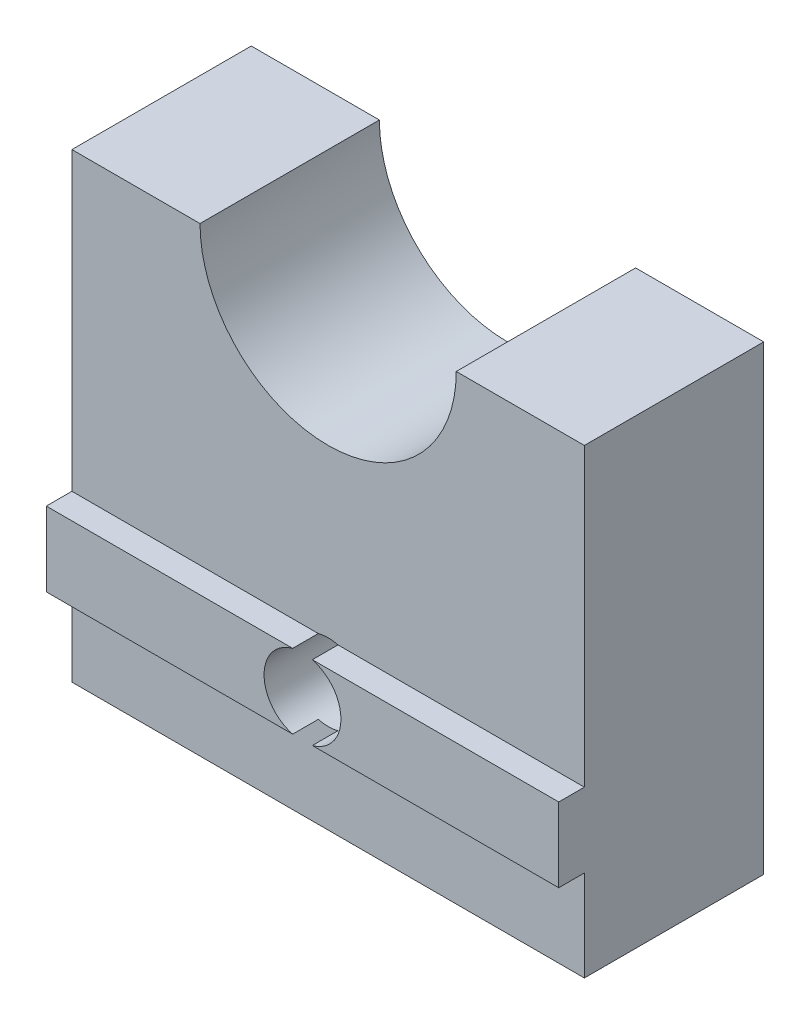
ISO-10303-21;
HEADER;
FILE_DESCRIPTION(('STEP AP214'),'2;1');
FILE_NAME('part.step','',(''),(''),'','','');
FILE_SCHEMA(('AUTOMOTIVE_DESIGN { 1 0 10303 214 1 1 1 1 }'));
ENDSEC;
DATA;
#1=APPLICATION_CONTEXT('core data for automotive mechanical design processes');
#2=APPLICATION_PROTOCOL_DEFINITION('international standard','automotive_design',2000,#1);
#3=PRODUCT_CONTEXT('',#1,'mechanical');
#4=PRODUCT('Part','Part','',(#3));
#5=PRODUCT_RELATED_PRODUCT_CATEGORY('part','',(#4));
#6=PRODUCT_DEFINITION_FORMATION('','',#4);
#7=PRODUCT_DEFINITION_CONTEXT('part definition',#1,'design');
#8=PRODUCT_DEFINITION('design','',#6,#7);
#9=PRODUCT_DEFINITION_SHAPE('','',#8);
#10=(LENGTH_UNIT() NAMED_UNIT(*) SI_UNIT(.MILLI.,.METRE.));
#11=(NAMED_UNIT(*) PLANE_ANGLE_UNIT() SI_UNIT($,.RADIAN.));
#12=(NAMED_UNIT(*) SI_UNIT($,.STERADIAN.) SOLID_ANGLE_UNIT());
#13=UNCERTAINTY_MEASURE_WITH_UNIT(LENGTH_MEASURE(1.E-05),#10,'distance_accuracy_value','');
#14=(GEOMETRIC_REPRESENTATION_CONTEXT(3) GLOBAL_UNCERTAINTY_ASSIGNED_CONTEXT((#13)) GLOBAL_UNIT_ASSIGNED_CONTEXT((#10,
#11,#12)) REPRESENTATION_CONTEXT('',''));
#15=CARTESIAN_POINT('',(0.,0.,0.));
#16=DIRECTION('',(0.,0.,1.));
#17=DIRECTION('',(1.,0.,0.));
#18=AXIS2_PLACEMENT_3D('',#15,#16,#17);
#19=CARTESIAN_POINT('',(13.0675723300356,6.45,7.));
#20=DIRECTION('',(0.,1.,0.));
#21=DIRECTION('',(0.,0.,1.));
#22=AXIS2_PLACEMENT_3D('',#19,#20,#21);
#23=PLANE('',#22);
#24=DIRECTION('',(0.,0.,1.));
#25=VECTOR('',#24,1.);
#26=CARTESIAN_POINT('',(-0.384057287393406,6.45000000000001,0.));
#27=LINE('',#26,#25);
#28=CARTESIAN_POINT('',(-0.384057287393428,6.45,7.));
#29=VERTEX_POINT('',#28);
#30=CARTESIAN_POINT('',(-0.384057287393431,6.45,8.));
#31=VERTEX_POINT('',#30);
#32=EDGE_CURVE('E240',#29,#31,#27,.T.);
#33=ORIENTED_EDGE('',*,*,#32,.F.);
#34=DIRECTION('',(-1.,0.,0.));
#35=VECTOR('',#34,1.);
#36=CARTESIAN_POINT('',(13.0675723300356,6.45,7.));
#37=LINE('',#36,#35);
#38=CARTESIAN_POINT('',(-10.,6.45,7.));
#39=VERTEX_POINT('',#38);
#40=EDGE_CURVE('E154',#29,#39,#37,.T.);
#41=ORIENTED_EDGE('',*,*,#40,.T.);
#42=DIRECTION('',(0.,0.,-1.));
#43=VECTOR('',#42,1.);
#44=CARTESIAN_POINT('',(-10.,6.45,7.));
#45=LINE('',#44,#43);
#46=CARTESIAN_POINT('',(-10.,6.45,8.));
#47=VERTEX_POINT('',#46);
#48=EDGE_CURVE('E230',#47,#39,#45,.T.);
#49=ORIENTED_EDGE('',*,*,#48,.F.);
#50=DIRECTION('',(-1.,0.,0.));
#51=VECTOR('',#50,1.);
#52=CARTESIAN_POINT('',(13.0675723300356,6.45,8.));
#53=LINE('',#52,#51);
#54=EDGE_CURVE('E155',#31,#47,#53,.T.);
#55=ORIENTED_EDGE('',*,*,#54,.F.);
#56=EDGE_LOOP('',(#33,#41,#49,#55));
#57=FACE_BOUND('',#56,.T.);
#58=ADVANCED_FACE('F33',(#57),#23,.T.);
#59=CARTESIAN_POINT('',(13.0675723300356,6.45,8.));
#60=DIRECTION('',(0.,0.,1.));
#61=DIRECTION('',(0.,-1.,0.));
#62=AXIS2_PLACEMENT_3D('',#59,#60,#61);
#63=PLANE('',#62);
#64=CARTESIAN_POINT('',(0.,5.,8.));
#65=DIRECTION('',(0.,0.,1.));
#66=DIRECTION('',(1.,0.,0.));
#67=AXIS2_PLACEMENT_3D('',#64,#65,#66);
#68=CIRCLE('',#67,1.5);
#69=CARTESIAN_POINT('',(0.384057287393432,3.55,8.));
#70=VERTEX_POINT('',#69);
#71=CARTESIAN_POINT('',(0.384057287393431,6.45,8.));
#72=VERTEX_POINT('',#71);
#73=EDGE_CURVE('E132',#70,#72,#68,.T.);
#74=ORIENTED_EDGE('',*,*,#73,.F.);
#75=DIRECTION('',(-1.,0.,0.));
#76=VECTOR('',#75,1.);
#77=CARTESIAN_POINT('',(13.0675723300356,3.55,8.));
#78=LINE('',#77,#76);
#79=CARTESIAN_POINT('',(10.,3.55,8.));
#80=VERTEX_POINT('',#79);
#81=EDGE_CURVE('E158',#80,#70,#78,.T.);
#82=ORIENTED_EDGE('',*,*,#81,.F.);
#83=DIRECTION('',(0.,-1.,0.));
#84=VECTOR('',#83,1.);
#85=CARTESIAN_POINT('',(10.,6.45,8.));
#86=LINE('',#85,#84);
#87=CARTESIAN_POINT('',(10.,6.45,8.));
#88=VERTEX_POINT('',#87);
#89=EDGE_CURVE('E153',#88,#80,#86,.T.);
#90=ORIENTED_EDGE('',*,*,#89,.F.);
#91=EDGE_CURVE('E147',#88,#72,#53,.T.);
#92=ORIENTED_EDGE('',*,*,#91,.T.);
#93=EDGE_LOOP('',(#74,#82,#90,#92));
#94=FACE_BOUND('',#93,.T.);
#95=ADVANCED_FACE('F152',(#94),#63,.T.);
#96=CARTESIAN_POINT('',(13.0675723300356,3.55,7.));
#97=DIRECTION('',(0.,-1.,0.));
#98=DIRECTION('',(0.,0.,-1.));
#99=AXIS2_PLACEMENT_3D('',#96,#97,#98);
#100=PLANE('',#99);
#101=DIRECTION('',(0.,0.,1.));
#102=VECTOR('',#101,1.);
#103=CARTESIAN_POINT('',(0.38405728739346,3.55000000000001,0.));
#104=LINE('',#103,#102);
#105=CARTESIAN_POINT('',(0.384057287393436,3.55,7.));
#106=VERTEX_POINT('',#105);
#107=EDGE_CURVE('E11',#106,#70,#104,.T.);
#108=ORIENTED_EDGE('',*,*,#107,.F.);
#109=DIRECTION('',(-1.,0.,0.));
#110=VECTOR('',#109,1.);
#111=CARTESIAN_POINT('',(13.0675723300356,3.55,7.));
#112=LINE('',#111,#110);
#113=CARTESIAN_POINT('',(10.,3.55,7.));
#114=VERTEX_POINT('',#113);
#115=EDGE_CURVE('E163',#114,#106,#112,.T.);
#116=ORIENTED_EDGE('',*,*,#115,.F.);
#117=DIRECTION('',(0.,0.,-1.));
#118=VECTOR('',#117,1.);
#119=CARTESIAN_POINT('',(10.,3.55,7.));
#120=LINE('',#119,#118);
#121=EDGE_CURVE('E167',#80,#114,#120,.T.);
#122=ORIENTED_EDGE('',*,*,#121,.F.);
#123=ORIENTED_EDGE('',*,*,#81,.T.);
#124=EDGE_LOOP('',(#108,#116,#122,#123));
#125=FACE_BOUND('',#124,.T.);
#126=ADVANCED_FACE('F257',(#125),#100,.T.);
#127=CARTESIAN_POINT('',(0.,18.,7.));
#128=DIRECTION('',(0.,0.,1.));
#129=DIRECTION('',(1.,0.,0.));
#130=AXIS2_PLACEMENT_3D('',#127,#128,#129);
#131=PLANE('',#130);
#132=CARTESIAN_POINT('',(0.,5.,7.));
#133=DIRECTION('',(0.,0.,1.));
#134=DIRECTION('',(1.,0.,0.));
#135=AXIS2_PLACEMENT_3D('',#132,#133,#134);
#136=CIRCLE('',#135,1.5);
#137=CARTESIAN_POINT('',(-0.38405728739346,3.55000000000001,7.));
#138=VERTEX_POINT('',#137);
#139=EDGE_CURVE('E149',#138,#106,#136,.T.);
#140=ORIENTED_EDGE('',*,*,#139,.F.);
#141=CARTESIAN_POINT('',(-10.,3.55,7.));
#142=VERTEX_POINT('',#141);
#143=EDGE_CURVE('E166',#138,#142,#112,.T.);
#144=ORIENTED_EDGE('',*,*,#143,.T.);
#145=DIRECTION('',(0.,-1.,0.));
#146=VECTOR('',#145,1.);
#147=CARTESIAN_POINT('',(-10.,18.,7.));
#148=LINE('',#147,#146);
#149=CARTESIAN_POINT('',(-10.,0.,7.));
#150=VERTEX_POINT('',#149);
#151=EDGE_CURVE('E176',#142,#150,#148,.T.);
#152=ORIENTED_EDGE('',*,*,#151,.T.);
#153=DIRECTION('',(1.,0.,0.));
#154=VECTOR('',#153,1.);
#155=CARTESIAN_POINT('',(-10.,0.,7.));
#156=LINE('',#155,#154);
#157=CARTESIAN_POINT('',(10.,0.,7.));
#158=VERTEX_POINT('',#157);
#159=EDGE_CURVE('E175',#150,#158,#156,.T.);
#160=ORIENTED_EDGE('',*,*,#159,.T.);
#161=DIRECTION('',(0.,1.,0.));
#162=VECTOR('',#161,1.);
#163=CARTESIAN_POINT('',(10.,0.,7.));
#164=LINE('',#163,#162);
#165=EDGE_CURVE('E179',#158,#114,#164,.T.);
#166=ORIENTED_EDGE('',*,*,#165,.T.);
#167=ORIENTED_EDGE('',*,*,#115,.T.);
#168=EDGE_LOOP('',(#140,#144,#152,#160,#166,#167));
#169=FACE_BOUND('',#168,.T.);
#170=ADVANCED_FACE('F221',(#169),#131,.T.);
#171=CARTESIAN_POINT('',(-10.,18.,7.));
#172=DIRECTION('',(1.,0.,0.));
#173=DIRECTION('',(0.,1.,0.));
#174=AXIS2_PLACEMENT_3D('',#171,#172,#173);
#175=PLANE('',#174);
#176=DIRECTION('',(0.,-1.,0.));
#177=VECTOR('',#176,1.);
#178=CARTESIAN_POINT('',(-10.,18.,0.));
#179=LINE('',#178,#177);
#180=CARTESIAN_POINT('',(-10.,18.,0.));
#181=VERTEX_POINT('',#180);
#182=CARTESIAN_POINT('',(-10.,0.,0.));
#183=VERTEX_POINT('',#182);
#184=EDGE_CURVE('E170',#181,#183,#179,.T.);
#185=ORIENTED_EDGE('',*,*,#184,.T.);
#186=DIRECTION('',(0.,0.,-1.));
#187=VECTOR('',#186,1.);
#188=CARTESIAN_POINT('',(-10.,0.,7.));
#189=LINE('',#188,#187);
#190=EDGE_CURVE('E214',#150,#183,#189,.T.);
#191=ORIENTED_EDGE('',*,*,#190,.F.);
#192=ORIENTED_EDGE('',*,*,#151,.F.);
#193=DIRECTION('',(0.,0.,1.));
#194=VECTOR('',#193,1.);
#195=CARTESIAN_POINT('',(-10.,3.55,7.));
#196=LINE('',#195,#194);
#197=CARTESIAN_POINT('',(-10.,3.55,8.));
#198=VERTEX_POINT('',#197);
#199=EDGE_CURVE('E229',#142,#198,#196,.T.);
#200=ORIENTED_EDGE('',*,*,#199,.T.);
#201=DIRECTION('',(0.,1.,0.));
#202=VECTOR('',#201,1.);
#203=CARTESIAN_POINT('',(-10.,6.45,8.));
#204=LINE('',#203,#202);
#205=EDGE_CURVE('E232',#198,#47,#204,.T.);
#206=ORIENTED_EDGE('',*,*,#205,.T.);
#207=ORIENTED_EDGE('',*,*,#48,.T.);
#208=CARTESIAN_POINT('',(-10.,18.,7.));
#209=VERTEX_POINT('',#208);
#210=EDGE_CURVE('E172',#209,#39,#148,.T.);
#211=ORIENTED_EDGE('',*,*,#210,.F.);
#212=DIRECTION('',(0.,0.,-1.));
#213=VECTOR('',#212,1.);
#214=CARTESIAN_POINT('',(-10.,18.,7.));
#215=LINE('',#214,#213);
#216=EDGE_CURVE('E187',#209,#181,#215,.T.);
#217=ORIENTED_EDGE('',*,*,#216,.T.);
#218=EDGE_LOOP('',(#185,#191,#192,#200,#206,#207,#211,#217));
#219=FACE_BOUND('',#218,.T.);
#220=ADVANCED_FACE('F35',(#219),#175,.F.);
#221=CARTESIAN_POINT('',(-10.,0.,7.));
#222=DIRECTION('',(0.,1.,0.));
#223=DIRECTION('',(-1.,0.,0.));
#224=AXIS2_PLACEMENT_3D('',#221,#222,#223);
#225=PLANE('',#224);
#226=DIRECTION('',(1.,0.,0.));
#227=VECTOR('',#226,1.);
#228=CARTESIAN_POINT('',(-10.,0.,0.));
#229=LINE('',#228,#227);
#230=CARTESIAN_POINT('',(10.,0.,0.));
#231=VERTEX_POINT('',#230);
#232=EDGE_CURVE('E190',#183,#231,#229,.T.);
#233=ORIENTED_EDGE('',*,*,#232,.T.);
#234=DIRECTION('',(0.,0.,-1.));
#235=VECTOR('',#234,1.);
#236=CARTESIAN_POINT('',(10.,0.,7.));
#237=LINE('',#236,#235);
#238=EDGE_CURVE('E211',#158,#231,#237,.T.);
#239=ORIENTED_EDGE('',*,*,#238,.F.);
#240=ORIENTED_EDGE('',*,*,#159,.F.);
#241=ORIENTED_EDGE('',*,*,#190,.T.);
#242=EDGE_LOOP('',(#233,#239,#240,#241));
#243=FACE_BOUND('',#242,.T.);
#244=ADVANCED_FACE('F293',(#243),#225,.F.);
#245=CARTESIAN_POINT('',(10.,0.,7.));
#246=DIRECTION('',(-1.,0.,0.));
#247=DIRECTION('',(0.,-1.,0.));
#248=AXIS2_PLACEMENT_3D('',#245,#246,#247);
#249=PLANE('',#248);
#250=DIRECTION('',(0.,1.,0.));
#251=VECTOR('',#250,1.);
#252=CARTESIAN_POINT('',(10.,0.,0.));
#253=LINE('',#252,#251);
#254=CARTESIAN_POINT('',(9.99999999999999,18.,0.));
#255=VERTEX_POINT('',#254);
#256=EDGE_CURVE('E192',#231,#255,#253,.T.);
#257=ORIENTED_EDGE('',*,*,#256,.T.);
#258=DIRECTION('',(0.,0.,-1.));
#259=VECTOR('',#258,1.);
#260=CARTESIAN_POINT('',(9.99999999999999,18.,7.));
#261=LINE('',#260,#259);
#262=CARTESIAN_POINT('',(9.99999999999999,18.,7.));
#263=VERTEX_POINT('',#262);
#264=EDGE_CURVE('E208',#263,#255,#261,.T.);
#265=ORIENTED_EDGE('',*,*,#264,.F.);
#266=CARTESIAN_POINT('',(10.,6.45,7.));
#267=VERTEX_POINT('',#266);
#268=EDGE_CURVE('E178',#267,#263,#164,.T.);
#269=ORIENTED_EDGE('',*,*,#268,.F.);
#270=DIRECTION('',(0.,0.,1.));
#271=VECTOR('',#270,1.);
#272=CARTESIAN_POINT('',(10.,6.45,7.));
#273=LINE('',#272,#271);
#274=EDGE_CURVE('E171',#267,#88,#273,.T.);
#275=ORIENTED_EDGE('',*,*,#274,.T.);
#276=ORIENTED_EDGE('',*,*,#89,.T.);
#277=ORIENTED_EDGE('',*,*,#121,.T.);
#278=ORIENTED_EDGE('',*,*,#165,.F.);
#279=ORIENTED_EDGE('',*,*,#238,.T.);
#280=EDGE_LOOP('',(#257,#265,#269,#275,#276,#277,#278,#279));
#281=FACE_BOUND('',#280,.T.);
#282=ADVANCED_FACE('F290',(#281),#249,.F.);
#283=CARTESIAN_POINT('',(9.99999999999999,18.,7.));
#284=DIRECTION('',(0.,-1.,0.));
#285=DIRECTION('',(1.,0.,0.));
#286=AXIS2_PLACEMENT_3D('',#283,#284,#285);
#287=PLANE('',#286);
#288=DIRECTION('',(-1.,0.,0.));
#289=VECTOR('',#288,1.);
#290=CARTESIAN_POINT('',(9.99999999999999,18.,0.));
#291=LINE('',#290,#289);
#292=CARTESIAN_POINT('',(5.,18.,0.));
#293=VERTEX_POINT('',#292);
#294=EDGE_CURVE('E194',#255,#293,#291,.T.);
#295=ORIENTED_EDGE('',*,*,#294,.T.);
#296=DIRECTION('',(0.,0.,-1.));
#297=VECTOR('',#296,1.);
#298=CARTESIAN_POINT('',(5.,18.,7.));
#299=LINE('',#298,#297);
#300=CARTESIAN_POINT('',(5.,18.,7.));
#301=VERTEX_POINT('',#300);
#302=EDGE_CURVE('E205',#301,#293,#299,.T.);
#303=ORIENTED_EDGE('',*,*,#302,.F.);
#304=DIRECTION('',(-1.,0.,0.));
#305=VECTOR('',#304,1.);
#306=CARTESIAN_POINT('',(9.99999999999999,18.,7.));
#307=LINE('',#306,#305);
#308=EDGE_CURVE('E181',#263,#301,#307,.T.);
#309=ORIENTED_EDGE('',*,*,#308,.F.);
#310=ORIENTED_EDGE('',*,*,#264,.T.);
#311=EDGE_LOOP('',(#295,#303,#309,#310));
#312=FACE_BOUND('',#311,.T.);
#313=ADVANCED_FACE('F286',(#312),#287,.F.);
#314=CARTESIAN_POINT('',(0.,18.,7.));
#315=DIRECTION('',(0.,0.,-1.));
#316=DIRECTION('',(-1.,0.,0.));
#317=AXIS2_PLACEMENT_3D('',#314,#315,#316);
#318=CYLINDRICAL_SURFACE('',#317,5.);
#319=CARTESIAN_POINT('',(0.,18.,0.));
#320=DIRECTION('',(0.,0.,-1.));
#321=DIRECTION('',(1.,0.,0.));
#322=AXIS2_PLACEMENT_3D('',#319,#320,#321);
#323=CIRCLE('',#322,5.);
#324=CARTESIAN_POINT('',(-5.,18.,0.));
#325=VERTEX_POINT('',#324);
#326=EDGE_CURVE('E196',#293,#325,#323,.T.);
#327=ORIENTED_EDGE('',*,*,#326,.T.);
#328=DIRECTION('',(0.,0.,-1.));
#329=VECTOR('',#328,1.);
#330=CARTESIAN_POINT('',(-5.,18.,7.));
#331=LINE('',#330,#329);
#332=CARTESIAN_POINT('',(-5.,18.,7.));
#333=VERTEX_POINT('',#332);
#334=EDGE_CURVE('E202',#333,#325,#331,.T.);
#335=ORIENTED_EDGE('',*,*,#334,.F.);
#336=CARTESIAN_POINT('',(0.,18.,7.));
#337=DIRECTION('',(0.,0.,-1.));
#338=DIRECTION('',(1.,0.,0.));
#339=AXIS2_PLACEMENT_3D('',#336,#337,#338);
#340=CIRCLE('',#339,5.);
#341=EDGE_CURVE('E183',#301,#333,#340,.T.);
#342=ORIENTED_EDGE('',*,*,#341,.F.);
#343=ORIENTED_EDGE('',*,*,#302,.T.);
#344=EDGE_LOOP('',(#327,#335,#342,#343));
#345=FACE_BOUND('',#344,.T.);
#346=ADVANCED_FACE('F282',(#345),#318,.F.);
#347=CARTESIAN_POINT('',(-5.,18.,7.));
#348=DIRECTION('',(0.,-1.,0.));
#349=DIRECTION('',(1.,0.,0.));
#350=AXIS2_PLACEMENT_3D('',#347,#348,#349);
#351=PLANE('',#350);
#352=DIRECTION('',(-1.,0.,0.));
#353=VECTOR('',#352,1.);
#354=CARTESIAN_POINT('',(-5.,18.,0.));
#355=LINE('',#354,#353);
#356=EDGE_CURVE('E198',#325,#181,#355,.T.);
#357=ORIENTED_EDGE('',*,*,#356,.T.);
#358=ORIENTED_EDGE('',*,*,#216,.F.);
#359=DIRECTION('',(-1.,0.,0.));
#360=VECTOR('',#359,1.);
#361=CARTESIAN_POINT('',(-5.,18.,7.));
#362=LINE('',#361,#360);
#363=EDGE_CURVE('E185',#333,#209,#362,.T.);
#364=ORIENTED_EDGE('',*,*,#363,.F.);
#365=ORIENTED_EDGE('',*,*,#334,.T.);
#366=EDGE_LOOP('',(#357,#358,#364,#365));
#367=FACE_BOUND('',#366,.T.);
#368=ADVANCED_FACE('F277',(#367),#351,.F.);
#369=CARTESIAN_POINT('',(0.,5.,7.));
#370=DIRECTION('',(0.,0.,1.));
#371=DIRECTION('',(1.,0.,0.));
#372=AXIS2_PLACEMENT_3D('',#369,#370,#371);
#373=CIRCLE('',#372,1.5);
#374=CARTESIAN_POINT('',(0.384057287393406,6.45000000000001,7.));
#375=VERTEX_POINT('',#374);
#376=EDGE_CURVE('E148',#375,#29,#373,.T.);
#377=ORIENTED_EDGE('',*,*,#376,.F.);
#378=EDGE_CURVE('E56',#267,#375,#37,.T.);
#379=ORIENTED_EDGE('',*,*,#378,.F.);
#380=ORIENTED_EDGE('',*,*,#268,.T.);
#381=ORIENTED_EDGE('',*,*,#308,.T.);
#382=ORIENTED_EDGE('',*,*,#341,.T.);
#383=ORIENTED_EDGE('',*,*,#363,.T.);
#384=ORIENTED_EDGE('',*,*,#210,.T.);
#385=ORIENTED_EDGE('',*,*,#40,.F.);
#386=EDGE_LOOP('',(#377,#379,#380,#381,#382,#383,#384,#385));
#387=FACE_BOUND('',#386,.T.);
#388=ADVANCED_FACE('F272',(#387),#131,.T.);
#389=CARTESIAN_POINT('',(0.,18.,0.));
#390=DIRECTION('',(0.,0.,1.));
#391=DIRECTION('',(1.,0.,0.));
#392=AXIS2_PLACEMENT_3D('',#389,#390,#391);
#393=PLANE('',#392);
#394=CARTESIAN_POINT('',(0.,5.,0.));
#395=DIRECTION('',(0.,0.,1.));
#396=DIRECTION('',(1.,0.,0.));
#397=AXIS2_PLACEMENT_3D('',#394,#395,#396);
#398=CIRCLE('',#397,1.5);
#399=CARTESIAN_POINT('',(1.5,5.,0.));
#400=VERTEX_POINT('',#399);
#401=EDGE_CURVE('E224',#400,#400,#398,.T.);
#402=ORIENTED_EDGE('',*,*,#401,.T.);
#403=EDGE_LOOP('',(#402));
#404=FACE_BOUND('',#403,.T.);
#405=ORIENTED_EDGE('',*,*,#184,.F.);
#406=ORIENTED_EDGE('',*,*,#356,.F.);
#407=ORIENTED_EDGE('',*,*,#326,.F.);
#408=ORIENTED_EDGE('',*,*,#294,.F.);
#409=ORIENTED_EDGE('',*,*,#256,.F.);
#410=ORIENTED_EDGE('',*,*,#232,.F.);
#411=EDGE_LOOP('',(#405,#406,#407,#408,#409,#410));
#412=FACE_BOUND('',#411,.T.);
#413=ADVANCED_FACE('F248',(#404,#412),#393,.F.);
#414=DIRECTION('',(0.,0.,1.));
#415=VECTOR('',#414,1.);
#416=CARTESIAN_POINT('',(0.384057287393406,6.45000000000001,0.));
#417=LINE('',#416,#415);
#418=EDGE_CURVE('E136',#72,#375,#417,.F.);
#419=ORIENTED_EDGE('',*,*,#418,.F.);
#420=ORIENTED_EDGE('',*,*,#91,.F.);
#421=ORIENTED_EDGE('',*,*,#274,.F.);
#422=ORIENTED_EDGE('',*,*,#378,.T.);
#423=EDGE_LOOP('',(#419,#420,#421,#422));
#424=FACE_BOUND('',#423,.T.);
#425=ADVANCED_FACE('F145',(#424),#23,.T.);
#426=CARTESIAN_POINT('',(-0.384057287393429,3.55,8.));
#427=VERTEX_POINT('',#426);
#428=EDGE_CURVE('E48',#31,#427,#68,.T.);
#429=ORIENTED_EDGE('',*,*,#428,.F.);
#430=ORIENTED_EDGE('',*,*,#54,.T.);
#431=ORIENTED_EDGE('',*,*,#205,.F.);
#432=EDGE_CURVE('E162',#427,#198,#78,.T.);
#433=ORIENTED_EDGE('',*,*,#432,.F.);
#434=EDGE_LOOP('',(#429,#430,#431,#433));
#435=FACE_BOUND('',#434,.T.);
#436=ADVANCED_FACE('F255',(#435),#63,.T.);
#437=DIRECTION('',(0.,0.,1.));
#438=VECTOR('',#437,1.);
#439=CARTESIAN_POINT('',(-0.38405728739346,3.55000000000001,0.));
#440=LINE('',#439,#438);
#441=EDGE_CURVE('E41',#427,#138,#440,.F.);
#442=ORIENTED_EDGE('',*,*,#441,.F.);
#443=ORIENTED_EDGE('',*,*,#432,.T.);
#444=ORIENTED_EDGE('',*,*,#199,.F.);
#445=ORIENTED_EDGE('',*,*,#143,.F.);
#446=EDGE_LOOP('',(#442,#443,#444,#445));
#447=FACE_BOUND('',#446,.T.);
#448=ADVANCED_FACE('F227',(#447),#100,.T.);
#449=CARTESIAN_POINT('',(0.,5.,0.));
#450=DIRECTION('',(0.,0.,1.));
#451=DIRECTION('',(1.,0.,0.));
#452=AXIS2_PLACEMENT_3D('',#449,#450,#451);
#453=CYLINDRICAL_SURFACE('',#452,1.5);
#454=ORIENTED_EDGE('',*,*,#32,.T.);
#455=ORIENTED_EDGE('',*,*,#428,.T.);
#456=ORIENTED_EDGE('',*,*,#441,.T.);
#457=ORIENTED_EDGE('',*,*,#139,.T.);
#458=ORIENTED_EDGE('',*,*,#107,.T.);
#459=ORIENTED_EDGE('',*,*,#73,.T.);
#460=ORIENTED_EDGE('',*,*,#418,.T.);
#461=ORIENTED_EDGE('',*,*,#376,.T.);
#462=EDGE_LOOP('',(#454,#455,#456,#457,#458,#459,#460,#461));
#463=FACE_BOUND('',#462,.T.);
#464=ORIENTED_EDGE('',*,*,#401,.F.);
#465=EDGE_LOOP('',(#464));
#466=FACE_BOUND('',#465,.T.);
#467=ADVANCED_FACE('F134',(#463,#466),#453,.F.);
#468=CLOSED_SHELL('',(#58,#95,#126,#170,#220,#244,#282,#313,#346,#368,#388,#413,#425,#436,#448,#467));
#469=MANIFOLD_SOLID_BREP('B2',#468);
#470=ADVANCED_BREP_SHAPE_REPRESENTATION('',(#18,#469),#14);
#471=SHAPE_DEFINITION_REPRESENTATION(#9,#470);
ENDSEC;
END-ISO-10303-21;
